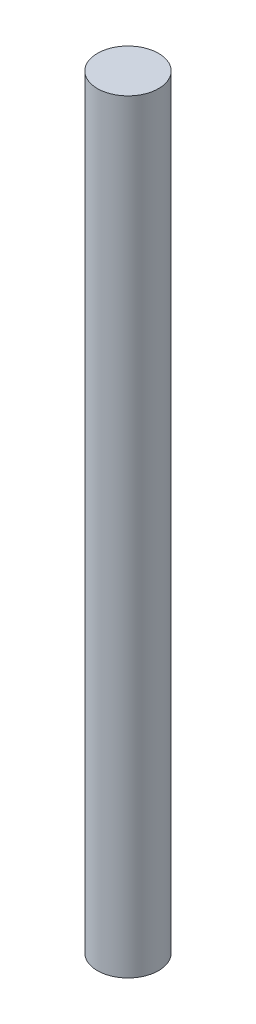
ISO-10303-21;
HEADER;
FILE_DESCRIPTION(('STEP AP214'),'2;1');
FILE_NAME('part.step','',(''),(''),'','','');
FILE_SCHEMA(('AUTOMOTIVE_DESIGN { 1 0 10303 214 1 1 1 1 }'));
ENDSEC;
DATA;
#1=APPLICATION_CONTEXT('core data for automotive mechanical design processes');
#2=APPLICATION_PROTOCOL_DEFINITION('international standard','automotive_design',2000,#1);
#3=PRODUCT_CONTEXT('',#1,'mechanical');
#4=PRODUCT('Part','Part','',(#3));
#5=PRODUCT_RELATED_PRODUCT_CATEGORY('part','',(#4));
#6=PRODUCT_DEFINITION_FORMATION('','',#4);
#7=PRODUCT_DEFINITION_CONTEXT('part definition',#1,'design');
#8=PRODUCT_DEFINITION('design','',#6,#7);
#9=PRODUCT_DEFINITION_SHAPE('','',#8);
#10=(LENGTH_UNIT() NAMED_UNIT(*) SI_UNIT(.MILLI.,.METRE.));
#11=(NAMED_UNIT(*) PLANE_ANGLE_UNIT() SI_UNIT($,.RADIAN.));
#12=(NAMED_UNIT(*) SI_UNIT($,.STERADIAN.) SOLID_ANGLE_UNIT());
#13=UNCERTAINTY_MEASURE_WITH_UNIT(LENGTH_MEASURE(1.E-05),#10,'distance_accuracy_value','');
#14=(GEOMETRIC_REPRESENTATION_CONTEXT(3) GLOBAL_UNCERTAINTY_ASSIGNED_CONTEXT((#13)) GLOBAL_UNIT_ASSIGNED_CONTEXT((#10,
#11,#12)) REPRESENTATION_CONTEXT('',''));
#15=CARTESIAN_POINT('',(0.,0.,0.));
#16=DIRECTION('',(0.,0.,1.));
#17=DIRECTION('',(1.,0.,0.));
#18=AXIS2_PLACEMENT_3D('',#15,#16,#17);
#19=CARTESIAN_POINT('',(0.,125.,0.));
#20=DIRECTION('',(0.,-1.,0.));
#21=DIRECTION('',(0.,0.,-1.));
#22=AXIS2_PLACEMENT_3D('',#19,#20,#21);
#23=CYLINDRICAL_SURFACE('',#22,5.);
#24=CARTESIAN_POINT('',(0.,125.,0.));
#25=DIRECTION('',(0.,1.,0.));
#26=DIRECTION('',(0.,0.,1.));
#27=AXIS2_PLACEMENT_3D('',#24,#25,#26);
#28=CIRCLE('',#27,5.);
#29=CARTESIAN_POINT('',(0.,125.,5.));
#30=VERTEX_POINT('',#29);
#31=EDGE_CURVE('E10',#30,#30,#28,.T.);
#32=ORIENTED_EDGE('',*,*,#31,.F.);
#33=EDGE_LOOP('',(#32));
#34=FACE_BOUND('',#33,.T.);
#35=CARTESIAN_POINT('',(0.,0.,0.));
#36=DIRECTION('',(0.,1.,0.));
#37=DIRECTION('',(0.,0.,1.));
#38=AXIS2_PLACEMENT_3D('',#35,#36,#37);
#39=CIRCLE('',#38,5.);
#40=CARTESIAN_POINT('',(0.,0.,5.));
#41=VERTEX_POINT('',#40);
#42=EDGE_CURVE('E33',#41,#41,#39,.T.);
#43=ORIENTED_EDGE('',*,*,#42,.T.);
#44=EDGE_LOOP('',(#43));
#45=FACE_BOUND('',#44,.T.);
#46=ADVANCED_FACE('F30',(#34,#45),#23,.T.);
#47=CARTESIAN_POINT('',(0.,125.,0.));
#48=DIRECTION('',(0.,1.,0.));
#49=DIRECTION('',(0.,0.,1.));
#50=AXIS2_PLACEMENT_3D('',#47,#48,#49);
#51=PLANE('',#50);
#52=ORIENTED_EDGE('',*,*,#31,.T.);
#53=EDGE_LOOP('',(#52));
#54=FACE_BOUND('',#53,.T.);
#55=ADVANCED_FACE('F45',(#54),#51,.T.);
#56=CARTESIAN_POINT('',(0.,0.,0.));
#57=DIRECTION('',(0.,1.,0.));
#58=DIRECTION('',(0.,0.,1.));
#59=AXIS2_PLACEMENT_3D('',#56,#57,#58);
#60=PLANE('',#59);
#61=ORIENTED_EDGE('',*,*,#42,.F.);
#62=EDGE_LOOP('',(#61));
#63=FACE_BOUND('',#62,.T.);
#64=ADVANCED_FACE('F43',(#63),#60,.F.);
#65=CLOSED_SHELL('',(#46,#55,#64));
#66=MANIFOLD_SOLID_BREP('B2',#65);
#67=ADVANCED_BREP_SHAPE_REPRESENTATION('',(#18,#66),#14);
#68=SHAPE_DEFINITION_REPRESENTATION(#9,#67);
ENDSEC;
END-ISO-10303-21;
